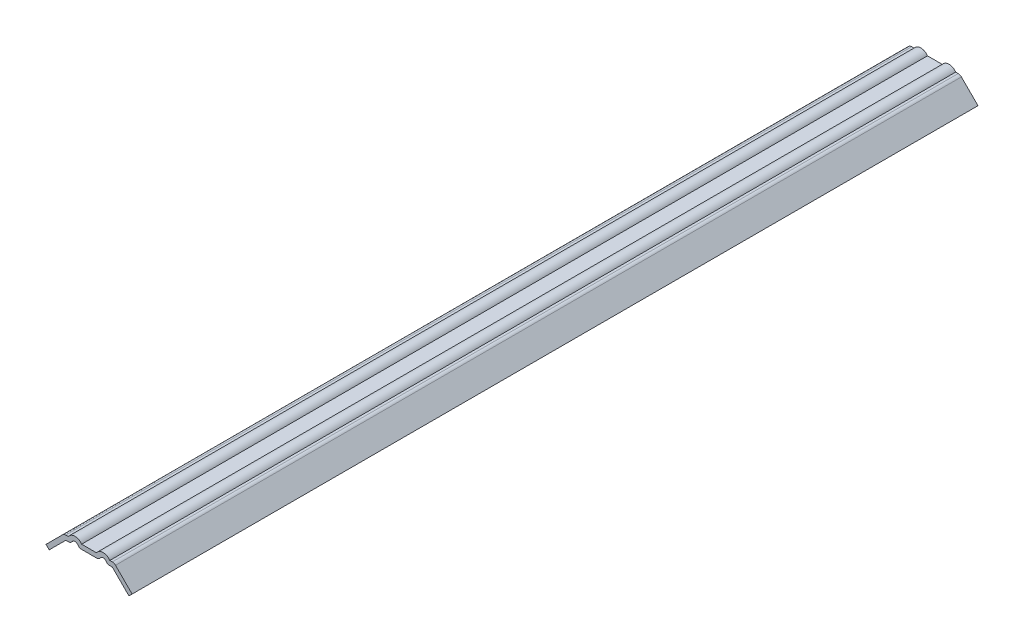
ISO-10303-21;
HEADER;
FILE_DESCRIPTION(('STEP AP214'),'2;1');
FILE_NAME('part.step','',(''),(''),'','','');
FILE_SCHEMA(('AUTOMOTIVE_DESIGN { 1 0 10303 214 1 1 1 1 }'));
ENDSEC;
DATA;
#1=APPLICATION_CONTEXT('core data for automotive mechanical design processes');
#2=APPLICATION_PROTOCOL_DEFINITION('international standard','automotive_design',2000,#1);
#3=PRODUCT_CONTEXT('',#1,'mechanical');
#4=PRODUCT('Part','Part','',(#3));
#5=PRODUCT_RELATED_PRODUCT_CATEGORY('part','',(#4));
#6=PRODUCT_DEFINITION_FORMATION('','',#4);
#7=PRODUCT_DEFINITION_CONTEXT('part definition',#1,'design');
#8=PRODUCT_DEFINITION('design','',#6,#7);
#9=PRODUCT_DEFINITION_SHAPE('','',#8);
#10=(LENGTH_UNIT() NAMED_UNIT(*) SI_UNIT(.MILLI.,.METRE.));
#11=(NAMED_UNIT(*) PLANE_ANGLE_UNIT() SI_UNIT($,.RADIAN.));
#12=(NAMED_UNIT(*) SI_UNIT($,.STERADIAN.) SOLID_ANGLE_UNIT());
#13=UNCERTAINTY_MEASURE_WITH_UNIT(LENGTH_MEASURE(1.E-05),#10,'distance_accuracy_value','');
#14=(GEOMETRIC_REPRESENTATION_CONTEXT(3) GLOBAL_UNCERTAINTY_ASSIGNED_CONTEXT((#13)) GLOBAL_UNIT_ASSIGNED_CONTEXT((#10,
#11,#12)) REPRESENTATION_CONTEXT('',''));
#15=CARTESIAN_POINT('',(0.,0.,0.));
#16=DIRECTION('',(0.,0.,1.));
#17=DIRECTION('',(1.,0.,0.));
#18=AXIS2_PLACEMENT_3D('',#15,#16,#17);
#19=CARTESIAN_POINT('',(-17.8707096809274,40.3213499836006,-571.5));
#20=DIRECTION('',(-0.707106781186544,0.707106781186551,0.));
#21=DIRECTION('',(-0.707106781186551,-0.707106781186544,0.));
#22=AXIS2_PLACEMENT_3D('',#19,#20,#21);
#23=PLANE('',#22);
#24=DIRECTION('',(-0.707106781186551,-0.707106781186544,0.));
#25=VECTOR('',#24,1.);
#26=CARTESIAN_POINT('',(-17.8707096809274,40.3213499836006,0.));
#27=LINE('',#26,#25);
#28=CARTESIAN_POINT('',(-17.8707096809274,40.3213499836006,0.));
#29=VERTEX_POINT('',#28);
#30=CARTESIAN_POINT('',(-29.0960298322639,29.0960298322642,0.));
#31=VERTEX_POINT('',#30);
#32=EDGE_CURVE('E250',#29,#31,#27,.T.);
#33=ORIENTED_EDGE('',*,*,#32,.F.);
#34=DIRECTION('',(0.,0.,1.));
#35=VECTOR('',#34,1.);
#36=CARTESIAN_POINT('',(-17.8707096809274,40.3213499836006,-571.5));
#37=LINE('',#36,#35);
#38=CARTESIAN_POINT('',(-17.8707096809274,40.3213499836006,-571.5));
#39=VERTEX_POINT('',#38);
#40=EDGE_CURVE('E11',#29,#39,#37,.F.);
#41=ORIENTED_EDGE('',*,*,#40,.T.);
#42=DIRECTION('',(-0.707106781186551,-0.707106781186544,0.));
#43=VECTOR('',#42,1.);
#44=CARTESIAN_POINT('',(-17.8707096809274,40.3213499836006,-571.5));
#45=LINE('',#44,#43);
#46=CARTESIAN_POINT('',(-29.0960298322639,29.0960298322642,-571.5));
#47=VERTEX_POINT('',#46);
#48=EDGE_CURVE('E251',#39,#47,#45,.T.);
#49=ORIENTED_EDGE('',*,*,#48,.T.);
#50=DIRECTION('',(0.,0.,1.));
#51=VECTOR('',#50,1.);
#52=CARTESIAN_POINT('',(-29.0960298322639,29.0960298322642,-571.5));
#53=LINE('',#52,#51);
#54=EDGE_CURVE('E273',#47,#31,#53,.T.);
#55=ORIENTED_EDGE('',*,*,#54,.T.);
#56=EDGE_LOOP('',(#33,#41,#49,#55));
#57=FACE_BOUND('',#56,.T.);
#58=ADVANCED_FACE('F37',(#57),#23,.T.);
#59=CARTESIAN_POINT('',(-11.90625,41.214088514544,-571.5));
#60=DIRECTION('',(0.,1.,0.));
#61=DIRECTION('',(-1.,0.,0.));
#62=AXIS2_PLACEMENT_3D('',#59,#60,#61);
#63=PLANE('',#62);
#64=DIRECTION('',(-1.,0.,0.));
#65=VECTOR('',#64,1.);
#66=CARTESIAN_POINT('',(-11.90625,41.214088514544,-571.5));
#67=LINE('',#66,#65);
#68=CARTESIAN_POINT('',(-14.017933514142,41.214088514544,-571.5));
#69=VERTEX_POINT('',#68);
#70=CARTESIAN_POINT('',(-15.7154482118708,41.214088514544,-571.5));
#71=VERTEX_POINT('',#70);
#72=EDGE_CURVE('E271',#69,#71,#67,.T.);
#73=ORIENTED_EDGE('',*,*,#72,.T.);
#74=DIRECTION('',(0.,0.,1.));
#75=VECTOR('',#74,1.);
#76=CARTESIAN_POINT('',(-15.7154482118708,41.214088514544,-571.5));
#77=LINE('',#76,#75);
#78=CARTESIAN_POINT('',(-15.7154482118708,41.214088514544,0.));
#79=VERTEX_POINT('',#78);
#80=EDGE_CURVE('E45',#71,#79,#77,.T.);
#81=ORIENTED_EDGE('',*,*,#80,.T.);
#82=DIRECTION('',(-1.,0.,0.));
#83=VECTOR('',#82,1.);
#84=CARTESIAN_POINT('',(-11.90625,41.214088514544,0.));
#85=LINE('',#84,#83);
#86=CARTESIAN_POINT('',(-14.017933514142,41.214088514544,0.));
#87=VERTEX_POINT('',#86);
#88=EDGE_CURVE('E254',#87,#79,#85,.T.);
#89=ORIENTED_EDGE('',*,*,#88,.F.);
#90=DIRECTION('',(0.,0.,1.));
#91=VECTOR('',#90,1.);
#92=CARTESIAN_POINT('',(-14.017933514142,41.214088514544,-571.5));
#93=LINE('',#92,#91);
#94=EDGE_CURVE('E296',#69,#87,#93,.T.);
#95=ORIENTED_EDGE('',*,*,#94,.F.);
#96=EDGE_LOOP('',(#73,#81,#89,#95));
#97=FACE_BOUND('',#96,.T.);
#98=ADVANCED_FACE('F331',(#97),#63,.T.);
#99=CARTESIAN_POINT('',(-9.525,38.166088514544,-571.5));
#100=DIRECTION('',(0.,0.,1.));
#101=DIRECTION('',(1.,0.,0.));
#102=AXIS2_PLACEMENT_3D('',#99,#100,#101);
#103=CYLINDRICAL_SURFACE('',#102,5.42925);
#104=CARTESIAN_POINT('',(-9.525,38.166088514544,0.));
#105=DIRECTION('',(0.,0.,1.));
#106=DIRECTION('',(1.,0.,0.));
#107=AXIS2_PLACEMENT_3D('',#104,#105,#106);
#108=CIRCLE('',#107,5.42925);
#109=CARTESIAN_POINT('',(-5.03206648585805,41.214088514544,0.));
#110=VERTEX_POINT('',#109);
#111=EDGE_CURVE('E291',#110,#87,#108,.T.);
#112=ORIENTED_EDGE('',*,*,#111,.F.);
#113=DIRECTION('',(0.,0.,1.));
#114=VECTOR('',#113,1.);
#115=CARTESIAN_POINT('',(-5.03206648585805,41.214088514544,-571.5));
#116=LINE('',#115,#114);
#117=CARTESIAN_POINT('',(-5.03206648585805,41.214088514544,-571.5));
#118=VERTEX_POINT('',#117);
#119=EDGE_CURVE('E299',#118,#110,#116,.T.);
#120=ORIENTED_EDGE('',*,*,#119,.F.);
#121=CARTESIAN_POINT('',(-9.525,38.166088514544,-571.5));
#122=DIRECTION('',(0.,0.,1.));
#123=DIRECTION('',(1.,0.,0.));
#124=AXIS2_PLACEMENT_3D('',#121,#122,#123);
#125=CIRCLE('',#124,5.42925);
#126=EDGE_CURVE('E268',#118,#69,#125,.T.);
#127=ORIENTED_EDGE('',*,*,#126,.T.);
#128=ORIENTED_EDGE('',*,*,#94,.T.);
#129=EDGE_LOOP('',(#112,#120,#127,#128));
#130=FACE_BOUND('',#129,.T.);
#131=ADVANCED_FACE('F340',(#130),#103,.T.);
#132=CARTESIAN_POINT('',(0.,41.214088514544,-571.5));
#133=DIRECTION('',(0.,1.,0.));
#134=DIRECTION('',(-1.,0.,0.));
#135=AXIS2_PLACEMENT_3D('',#132,#133,#134);
#136=PLANE('',#135);
#137=DIRECTION('',(-1.,0.,0.));
#138=VECTOR('',#137,1.);
#139=CARTESIAN_POINT('',(0.,41.214088514544,0.));
#140=LINE('',#139,#138);
#141=CARTESIAN_POINT('',(5.03206648585797,41.214088514544,0.));
#142=VERTEX_POINT('',#141);
#143=EDGE_CURVE('E288',#142,#110,#140,.T.);
#144=ORIENTED_EDGE('',*,*,#143,.F.);
#145=DIRECTION('',(0.,0.,1.));
#146=VECTOR('',#145,1.);
#147=CARTESIAN_POINT('',(5.03206648585797,41.214088514544,-571.5));
#148=LINE('',#147,#146);
#149=CARTESIAN_POINT('',(5.03206648585797,41.214088514544,-571.5));
#150=VERTEX_POINT('',#149);
#151=EDGE_CURVE('E346',#150,#142,#148,.T.);
#152=ORIENTED_EDGE('',*,*,#151,.F.);
#153=DIRECTION('',(-1.,0.,0.));
#154=VECTOR('',#153,1.);
#155=CARTESIAN_POINT('',(0.,41.214088514544,-571.5));
#156=LINE('',#155,#154);
#157=EDGE_CURVE('E265',#150,#118,#156,.T.);
#158=ORIENTED_EDGE('',*,*,#157,.T.);
#159=ORIENTED_EDGE('',*,*,#119,.T.);
#160=EDGE_LOOP('',(#144,#152,#158,#159));
#161=FACE_BOUND('',#160,.T.);
#162=ADVANCED_FACE('F344',(#161),#136,.T.);
#163=CARTESIAN_POINT('',(0.,38.166088514544,-571.5));
#164=DIRECTION('',(0.,1.,0.));
#165=DIRECTION('',(-1.,0.,0.));
#166=AXIS2_PLACEMENT_3D('',#163,#164,#165);
#167=PLANE('',#166);
#168=DIRECTION('',(-1.,0.,0.));
#169=VECTOR('',#168,1.);
#170=CARTESIAN_POINT('',(0.,38.166088514544,0.));
#171=LINE('',#170,#169);
#172=CARTESIAN_POINT('',(5.03206648585797,38.166088514544,0.));
#173=VERTEX_POINT('',#172);
#174=CARTESIAN_POINT('',(-5.03206648585804,38.166088514544,0.));
#175=VERTEX_POINT('',#174);
#176=EDGE_CURVE('E285',#173,#175,#171,.T.);
#177=ORIENTED_EDGE('',*,*,#176,.T.);
#178=DIRECTION('',(0.,0.,1.));
#179=VECTOR('',#178,1.);
#180=CARTESIAN_POINT('',(-5.03206648585804,38.166088514544,-571.5));
#181=LINE('',#180,#179);
#182=CARTESIAN_POINT('',(-5.03206648585804,38.166088514544,-571.5));
#183=VERTEX_POINT('',#182);
#184=EDGE_CURVE('E319',#175,#183,#181,.F.);
#185=ORIENTED_EDGE('',*,*,#184,.T.);
#186=DIRECTION('',(-1.,0.,0.));
#187=VECTOR('',#186,1.);
#188=CARTESIAN_POINT('',(0.,38.166088514544,-571.5));
#189=LINE('',#188,#187);
#190=CARTESIAN_POINT('',(5.03206648585797,38.166088514544,-571.5));
#191=VERTEX_POINT('',#190);
#192=EDGE_CURVE('E263',#191,#183,#189,.T.);
#193=ORIENTED_EDGE('',*,*,#192,.F.);
#194=DIRECTION('',(0.,0.,1.));
#195=VECTOR('',#194,1.);
#196=CARTESIAN_POINT('',(5.03206648585797,38.166088514544,-571.5));
#197=LINE('',#196,#195);
#198=EDGE_CURVE('E234',#173,#191,#197,.F.);
#199=ORIENTED_EDGE('',*,*,#198,.F.);
#200=EDGE_LOOP('',(#177,#185,#193,#199));
#201=FACE_BOUND('',#200,.T.);
#202=ADVANCED_FACE('F460',(#201),#167,.F.);
#203=CARTESIAN_POINT('',(-9.525,38.166088514544,-571.5));
#204=DIRECTION('',(0.,0.,1.));
#205=DIRECTION('',(1.,0.,0.));
#206=AXIS2_PLACEMENT_3D('',#203,#204,#205);
#207=CYLINDRICAL_SURFACE('',#206,2.38125);
#208=CARTESIAN_POINT('',(-9.525,38.166088514544,-571.5));
#209=DIRECTION('',(0.,0.,1.));
#210=DIRECTION('',(1.,0.,0.));
#211=AXIS2_PLACEMENT_3D('',#208,#209,#210);
#212=CIRCLE('',#211,2.38125);
#213=CARTESIAN_POINT('',(-7.55441512537634,39.5029306198071,-571.5));
#214=VERTEX_POINT('',#213);
#215=CARTESIAN_POINT('',(-11.4955848746237,39.5029306198071,-571.5));
#216=VERTEX_POINT('',#215);
#217=EDGE_CURVE('E261',#214,#216,#212,.T.);
#218=ORIENTED_EDGE('',*,*,#217,.F.);
#219=DIRECTION('',(0.,0.,1.));
#220=VECTOR('',#219,1.);
#221=CARTESIAN_POINT('',(-7.55441512537634,39.5029306198071,-571.5));
#222=LINE('',#221,#220);
#223=CARTESIAN_POINT('',(-7.55441512537634,39.5029306198071,0.));
#224=VERTEX_POINT('',#223);
#225=EDGE_CURVE('E310',#214,#224,#222,.T.);
#226=ORIENTED_EDGE('',*,*,#225,.T.);
#227=CARTESIAN_POINT('',(-9.525,38.166088514544,0.));
#228=DIRECTION('',(0.,0.,1.));
#229=DIRECTION('',(1.,0.,0.));
#230=AXIS2_PLACEMENT_3D('',#227,#228,#229);
#231=CIRCLE('',#230,2.38125);
#232=CARTESIAN_POINT('',(-11.4955848746237,39.5029306198071,0.));
#233=VERTEX_POINT('',#232);
#234=EDGE_CURVE('E282',#224,#233,#231,.T.);
#235=ORIENTED_EDGE('',*,*,#234,.T.);
#236=DIRECTION('',(0.,0.,1.));
#237=VECTOR('',#236,1.);
#238=CARTESIAN_POINT('',(-11.4955848746237,39.5029306198071,-571.5));
#239=LINE('',#238,#237);
#240=EDGE_CURVE('E298',#233,#216,#239,.F.);
#241=ORIENTED_EDGE('',*,*,#240,.T.);
#242=EDGE_LOOP('',(#218,#226,#235,#241));
#243=FACE_BOUND('',#242,.T.);
#244=ADVANCED_FACE('F408',(#243),#207,.F.);
#245=CARTESIAN_POINT('',(-11.90625,38.166088514544,-571.5));
#246=DIRECTION('',(0.,1.,0.));
#247=DIRECTION('',(-1.,0.,0.));
#248=AXIS2_PLACEMENT_3D('',#245,#246,#247);
#249=PLANE('',#248);
#250=DIRECTION('',(-1.,0.,0.));
#251=VECTOR('',#250,1.);
#252=CARTESIAN_POINT('',(-11.90625,38.166088514544,-571.5));
#253=LINE('',#252,#251);
#254=CARTESIAN_POINT('',(-14.017933514142,38.166088514544,-571.5));
#255=VERTEX_POINT('',#254);
#256=CARTESIAN_POINT('',(-15.7154482118708,38.166088514544,-571.5));
#257=VERTEX_POINT('',#256);
#258=EDGE_CURVE('E259',#255,#257,#253,.T.);
#259=ORIENTED_EDGE('',*,*,#258,.F.);
#260=DIRECTION('',(0.,0.,1.));
#261=VECTOR('',#260,1.);
#262=CARTESIAN_POINT('',(-14.017933514142,38.166088514544,-571.5));
#263=LINE('',#262,#261);
#264=CARTESIAN_POINT('',(-14.017933514142,38.166088514544,0.));
#265=VERTEX_POINT('',#264);
#266=EDGE_CURVE('E325',#255,#265,#263,.T.);
#267=ORIENTED_EDGE('',*,*,#266,.T.);
#268=DIRECTION('',(-1.,0.,0.));
#269=VECTOR('',#268,1.);
#270=CARTESIAN_POINT('',(-11.90625,38.166088514544,0.));
#271=LINE('',#270,#269);
#272=CARTESIAN_POINT('',(-15.7154482118708,38.166088514544,0.));
#273=VERTEX_POINT('',#272);
#274=EDGE_CURVE('E280',#265,#273,#271,.T.);
#275=ORIENTED_EDGE('',*,*,#274,.T.);
#276=DIRECTION('',(0.,0.,1.));
#277=VECTOR('',#276,1.);
#278=CARTESIAN_POINT('',(-15.7154482118708,38.166088514544,-571.5));
#279=LINE('',#278,#277);
#280=EDGE_CURVE('E301',#257,#273,#279,.T.);
#281=ORIENTED_EDGE('',*,*,#280,.F.);
#282=EDGE_LOOP('',(#259,#267,#275,#281));
#283=FACE_BOUND('',#282,.T.);
#284=ADVANCED_FACE('F416',(#283),#249,.F.);
#285=CARTESIAN_POINT('',(-15.7154482118708,38.166088514544,-571.5));
#286=DIRECTION('',(-0.707106781186544,0.707106781186551,0.));
#287=DIRECTION('',(-0.707106781186551,-0.707106781186544,0.));
#288=AXIS2_PLACEMENT_3D('',#285,#286,#287);
#289=PLANE('',#288);
#290=DIRECTION('',(-0.707106781186551,-0.707106781186544,0.));
#291=VECTOR('',#290,1.);
#292=CARTESIAN_POINT('',(-15.7154482118708,38.166088514544,0.));
#293=LINE('',#292,#291);
#294=CARTESIAN_POINT('',(-26.9407683632073,26.9407683632076,0.));
#295=VERTEX_POINT('',#294);
#296=EDGE_CURVE('E278',#273,#295,#293,.T.);
#297=ORIENTED_EDGE('',*,*,#296,.T.);
#298=DIRECTION('',(0.,0.,1.));
#299=VECTOR('',#298,1.);
#300=CARTESIAN_POINT('',(-26.9407683632073,26.9407683632076,-571.5));
#301=LINE('',#300,#299);
#302=CARTESIAN_POINT('',(-26.9407683632073,26.9407683632076,-571.5));
#303=VERTEX_POINT('',#302);
#304=EDGE_CURVE('E304',#303,#295,#301,.T.);
#305=ORIENTED_EDGE('',*,*,#304,.F.);
#306=DIRECTION('',(-0.707106781186551,-0.707106781186544,0.));
#307=VECTOR('',#306,1.);
#308=CARTESIAN_POINT('',(-15.7154482118708,38.166088514544,-571.5));
#309=LINE('',#308,#307);
#310=EDGE_CURVE('E257',#257,#303,#309,.T.);
#311=ORIENTED_EDGE('',*,*,#310,.F.);
#312=ORIENTED_EDGE('',*,*,#280,.T.);
#313=EDGE_LOOP('',(#297,#305,#311,#312));
#314=FACE_BOUND('',#313,.T.);
#315=ADVANCED_FACE('F423',(#314),#289,.F.);
#316=CARTESIAN_POINT('',(-26.9407683632073,26.9407683632076,-571.5));
#317=DIRECTION('',(0.70710678118655,0.707106781186545,0.));
#318=DIRECTION('',(-0.707106781186545,0.70710678118655,0.));
#319=AXIS2_PLACEMENT_3D('',#316,#317,#318);
#320=PLANE('',#319);
#321=DIRECTION('',(-0.707106781186545,0.70710678118655,0.));
#322=VECTOR('',#321,1.);
#323=CARTESIAN_POINT('',(-26.9407683632073,26.9407683632076,0.));
#324=LINE('',#323,#322);
#325=EDGE_CURVE('E275',#295,#31,#324,.T.);
#326=ORIENTED_EDGE('',*,*,#325,.T.);
#327=ORIENTED_EDGE('',*,*,#54,.F.);
#328=DIRECTION('',(-0.707106781186545,0.70710678118655,0.));
#329=VECTOR('',#328,1.);
#330=CARTESIAN_POINT('',(-26.9407683632073,26.9407683632076,-571.5));
#331=LINE('',#330,#329);
#332=EDGE_CURVE('E253',#303,#47,#331,.T.);
#333=ORIENTED_EDGE('',*,*,#332,.F.);
#334=ORIENTED_EDGE('',*,*,#304,.T.);
#335=EDGE_LOOP('',(#326,#327,#333,#334));
#336=FACE_BOUND('',#335,.T.);
#337=ADVANCED_FACE('F426',(#336),#320,.F.);
#338=CARTESIAN_POINT('',(-9.525,38.166088514544,-571.5));
#339=DIRECTION('',(0.,0.,1.));
#340=DIRECTION('',(1.,0.,0.));
#341=AXIS2_PLACEMENT_3D('',#338,#339,#340);
#342=PLANE('',#341);
#343=ORIENTED_EDGE('',*,*,#192,.T.);
#344=CARTESIAN_POINT('',(-5.03206648585804,41.214088514544,-571.5));
#345=DIRECTION('',(0.,0.,1.));
#346=DIRECTION('',(1.,0.,0.));
#347=AXIS2_PLACEMENT_3D('',#344,#345,#346);
#348=CIRCLE('',#347,3.048);
#349=EDGE_CURVE('E323',#183,#214,#348,.F.);
#350=ORIENTED_EDGE('',*,*,#349,.T.);
#351=ORIENTED_EDGE('',*,*,#217,.T.);
#352=CARTESIAN_POINT('',(-14.017933514142,41.214088514544,-571.5));
#353=DIRECTION('',(0.,0.,1.));
#354=DIRECTION('',(1.,0.,0.));
#355=AXIS2_PLACEMENT_3D('',#352,#353,#354);
#356=CIRCLE('',#355,3.048);
#357=EDGE_CURVE('E52',#216,#255,#356,.F.);
#358=ORIENTED_EDGE('',*,*,#357,.T.);
#359=ORIENTED_EDGE('',*,*,#258,.T.);
#360=ORIENTED_EDGE('',*,*,#310,.T.);
#361=ORIENTED_EDGE('',*,*,#332,.T.);
#362=ORIENTED_EDGE('',*,*,#48,.F.);
#363=CARTESIAN_POINT('',(-15.7154482118708,38.166088514544,-571.5));
#364=DIRECTION('',(0.,0.,1.));
#365=DIRECTION('',(1.,0.,0.));
#366=AXIS2_PLACEMENT_3D('',#363,#364,#365);
#367=CIRCLE('',#366,3.048);
#368=EDGE_CURVE('E59',#39,#71,#367,.F.);
#369=ORIENTED_EDGE('',*,*,#368,.T.);
#370=ORIENTED_EDGE('',*,*,#72,.F.);
#371=ORIENTED_EDGE('',*,*,#126,.F.);
#372=ORIENTED_EDGE('',*,*,#157,.F.);
#373=CARTESIAN_POINT('',(9.52499999999993,38.166088514544,-571.5));
#374=DIRECTION('',(0.,0.,-1.));
#375=DIRECTION('',(-1.,0.,0.));
#376=AXIS2_PLACEMENT_3D('',#373,#374,#375);
#377=CIRCLE('',#376,5.42925);
#378=CARTESIAN_POINT('',(14.0179335141419,41.214088514544,-571.5));
#379=VERTEX_POINT('',#378);
#380=EDGE_CURVE('E216',#150,#379,#377,.T.);
#381=ORIENTED_EDGE('',*,*,#380,.T.);
#382=DIRECTION('',(1.,0.,0.));
#383=VECTOR('',#382,1.);
#384=CARTESIAN_POINT('',(11.9062499999999,41.214088514544,-571.5));
#385=LINE('',#384,#383);
#386=CARTESIAN_POINT('',(15.7154482118707,41.214088514544,-571.5));
#387=VERTEX_POINT('',#386);
#388=EDGE_CURVE('E212',#379,#387,#385,.T.);
#389=ORIENTED_EDGE('',*,*,#388,.T.);
#390=CARTESIAN_POINT('',(15.7154482118707,38.166088514544,-571.5));
#391=DIRECTION('',(0.,0.,-1.));
#392=DIRECTION('',(-1.,0.,0.));
#393=AXIS2_PLACEMENT_3D('',#390,#391,#392);
#394=CIRCLE('',#393,3.048);
#395=CARTESIAN_POINT('',(17.8707096809273,40.3213499836006,-571.5));
#396=VERTEX_POINT('',#395);
#397=EDGE_CURVE('E203',#396,#387,#394,.F.);
#398=ORIENTED_EDGE('',*,*,#397,.F.);
#399=DIRECTION('',(0.707106781186552,-0.707106781186543,0.));
#400=VECTOR('',#399,1.);
#401=CARTESIAN_POINT('',(17.8707096809273,40.3213499836006,-571.5));
#402=LINE('',#401,#400);
#403=CARTESIAN_POINT('',(29.0960298322639,29.0960298322643,-571.5));
#404=VERTEX_POINT('',#403);
#405=EDGE_CURVE('E197',#396,#404,#402,.T.);
#406=ORIENTED_EDGE('',*,*,#405,.T.);
#407=DIRECTION('',(0.707106781186544,0.707106781186551,0.));
#408=VECTOR('',#407,1.);
#409=CARTESIAN_POINT('',(26.9407683632073,26.9407683632077,-571.5));
#410=LINE('',#409,#408);
#411=CARTESIAN_POINT('',(26.9407683632073,26.9407683632077,-571.5));
#412=VERTEX_POINT('',#411);
#413=EDGE_CURVE('E187',#412,#404,#410,.T.);
#414=ORIENTED_EDGE('',*,*,#413,.F.);
#415=DIRECTION('',(0.707106781186552,-0.707106781186543,0.));
#416=VECTOR('',#415,1.);
#417=CARTESIAN_POINT('',(15.7154482118707,38.166088514544,-571.5));
#418=LINE('',#417,#416);
#419=CARTESIAN_POINT('',(15.7154482118707,38.166088514544,-571.5));
#420=VERTEX_POINT('',#419);
#421=EDGE_CURVE('E196',#420,#412,#418,.T.);
#422=ORIENTED_EDGE('',*,*,#421,.F.);
#423=DIRECTION('',(1.,0.,0.));
#424=VECTOR('',#423,1.);
#425=CARTESIAN_POINT('',(11.9062499999999,38.166088514544,-571.5));
#426=LINE('',#425,#424);
#427=CARTESIAN_POINT('',(14.0179335141419,38.166088514544,-571.5));
#428=VERTEX_POINT('',#427);
#429=EDGE_CURVE('E357',#428,#420,#426,.T.);
#430=ORIENTED_EDGE('',*,*,#429,.F.);
#431=CARTESIAN_POINT('',(14.0179335141419,41.214088514544,-571.5));
#432=DIRECTION('',(0.,0.,-1.));
#433=DIRECTION('',(-1.,0.,0.));
#434=AXIS2_PLACEMENT_3D('',#431,#432,#433);
#435=CIRCLE('',#434,3.048);
#436=CARTESIAN_POINT('',(11.4955848746236,39.5029306198072,-571.5));
#437=VERTEX_POINT('',#436);
#438=EDGE_CURVE('E238',#437,#428,#435,.F.);
#439=ORIENTED_EDGE('',*,*,#438,.F.);
#440=CARTESIAN_POINT('',(9.52499999999993,38.166088514544,-571.5));
#441=DIRECTION('',(0.,0.,-1.));
#442=DIRECTION('',(-1.,0.,0.));
#443=AXIS2_PLACEMENT_3D('',#440,#441,#442);
#444=CIRCLE('',#443,2.38125);
#445=CARTESIAN_POINT('',(7.55441512537626,39.5029306198072,-571.5));
#446=VERTEX_POINT('',#445);
#447=EDGE_CURVE('E354',#446,#437,#444,.T.);
#448=ORIENTED_EDGE('',*,*,#447,.F.);
#449=CARTESIAN_POINT('',(5.03206648585796,41.214088514544,-571.5));
#450=DIRECTION('',(0.,0.,-1.));
#451=DIRECTION('',(-1.,0.,0.));
#452=AXIS2_PLACEMENT_3D('',#449,#450,#451);
#453=CIRCLE('',#452,3.048);
#454=EDGE_CURVE('E240',#191,#446,#453,.F.);
#455=ORIENTED_EDGE('',*,*,#454,.F.);
#456=EDGE_LOOP('',(#343,#350,#351,#358,#359,#360,#361,#362,#369,#370,#371,#372,#381,#389,#398,
#406,#414,#422,#430,#439,#448,#455));
#457=FACE_BOUND('',#456,.T.);
#458=ADVANCED_FACE('F201',(#457),#342,.F.);
#459=CARTESIAN_POINT('',(-9.525,38.166088514544,0.));
#460=DIRECTION('',(0.,0.,1.));
#461=DIRECTION('',(1.,0.,0.));
#462=AXIS2_PLACEMENT_3D('',#459,#460,#461);
#463=PLANE('',#462);
#464=ORIENTED_EDGE('',*,*,#234,.F.);
#465=CARTESIAN_POINT('',(-5.03206648585804,41.214088514544,0.));
#466=DIRECTION('',(0.,0.,1.));
#467=DIRECTION('',(1.,0.,0.));
#468=AXIS2_PLACEMENT_3D('',#465,#466,#467);
#469=CIRCLE('',#468,3.048);
#470=EDGE_CURVE('E317',#224,#175,#469,.T.);
#471=ORIENTED_EDGE('',*,*,#470,.T.);
#472=ORIENTED_EDGE('',*,*,#176,.F.);
#473=CARTESIAN_POINT('',(5.03206648585796,41.214088514544,0.));
#474=DIRECTION('',(0.,0.,-1.));
#475=DIRECTION('',(-1.,0.,0.));
#476=AXIS2_PLACEMENT_3D('',#473,#474,#475);
#477=CIRCLE('',#476,3.048);
#478=CARTESIAN_POINT('',(7.55441512537626,39.5029306198072,0.));
#479=VERTEX_POINT('',#478);
#480=EDGE_CURVE('E231',#479,#173,#477,.T.);
#481=ORIENTED_EDGE('',*,*,#480,.F.);
#482=CARTESIAN_POINT('',(9.52499999999993,38.166088514544,0.));
#483=DIRECTION('',(0.,0.,-1.));
#484=DIRECTION('',(-1.,0.,0.));
#485=AXIS2_PLACEMENT_3D('',#482,#483,#484);
#486=CIRCLE('',#485,2.38125);
#487=CARTESIAN_POINT('',(11.4955848746236,39.5029306198072,0.));
#488=VERTEX_POINT('',#487);
#489=EDGE_CURVE('E370',#479,#488,#486,.T.);
#490=ORIENTED_EDGE('',*,*,#489,.T.);
#491=CARTESIAN_POINT('',(14.0179335141419,41.214088514544,0.));
#492=DIRECTION('',(0.,0.,-1.));
#493=DIRECTION('',(-1.,0.,0.));
#494=AXIS2_PLACEMENT_3D('',#491,#492,#493);
#495=CIRCLE('',#494,3.048);
#496=CARTESIAN_POINT('',(14.0179335141419,38.166088514544,0.));
#497=VERTEX_POINT('',#496);
#498=EDGE_CURVE('E229',#497,#488,#495,.T.);
#499=ORIENTED_EDGE('',*,*,#498,.F.);
#500=DIRECTION('',(1.,0.,0.));
#501=VECTOR('',#500,1.);
#502=CARTESIAN_POINT('',(11.9062499999999,38.166088514544,0.));
#503=LINE('',#502,#501);
#504=CARTESIAN_POINT('',(15.7154482118707,38.166088514544,0.));
#505=VERTEX_POINT('',#504);
#506=EDGE_CURVE('E367',#497,#505,#503,.T.);
#507=ORIENTED_EDGE('',*,*,#506,.T.);
#508=DIRECTION('',(0.707106781186552,-0.707106781186543,0.));
#509=VECTOR('',#508,1.);
#510=CARTESIAN_POINT('',(15.7154482118707,38.166088514544,0.));
#511=LINE('',#510,#509);
#512=CARTESIAN_POINT('',(26.9407683632073,26.9407683632077,0.));
#513=VERTEX_POINT('',#512);
#514=EDGE_CURVE('E364',#505,#513,#511,.T.);
#515=ORIENTED_EDGE('',*,*,#514,.T.);
#516=DIRECTION('',(0.707106781186544,0.707106781186551,0.));
#517=VECTOR('',#516,1.);
#518=CARTESIAN_POINT('',(26.9407683632073,26.9407683632077,0.));
#519=LINE('',#518,#517);
#520=CARTESIAN_POINT('',(29.0960298322639,29.0960298322643,0.));
#521=VERTEX_POINT('',#520);
#522=EDGE_CURVE('E362',#513,#521,#519,.T.);
#523=ORIENTED_EDGE('',*,*,#522,.T.);
#524=DIRECTION('',(0.707106781186552,-0.707106781186543,0.));
#525=VECTOR('',#524,1.);
#526=CARTESIAN_POINT('',(17.8707096809273,40.3213499836006,0.));
#527=LINE('',#526,#525);
#528=CARTESIAN_POINT('',(17.8707096809273,40.3213499836006,0.));
#529=VERTEX_POINT('',#528);
#530=EDGE_CURVE('E211',#529,#521,#527,.T.);
#531=ORIENTED_EDGE('',*,*,#530,.F.);
#532=CARTESIAN_POINT('',(15.7154482118707,38.166088514544,0.));
#533=DIRECTION('',(0.,0.,-1.));
#534=DIRECTION('',(-1.,0.,0.));
#535=AXIS2_PLACEMENT_3D('',#532,#533,#534);
#536=CIRCLE('',#535,3.048);
#537=CARTESIAN_POINT('',(15.7154482118707,41.214088514544,0.));
#538=VERTEX_POINT('',#537);
#539=EDGE_CURVE('E227',#538,#529,#536,.T.);
#540=ORIENTED_EDGE('',*,*,#539,.F.);
#541=DIRECTION('',(1.,0.,0.));
#542=VECTOR('',#541,1.);
#543=CARTESIAN_POINT('',(11.9062499999999,41.214088514544,0.));
#544=LINE('',#543,#542);
#545=CARTESIAN_POINT('',(14.0179335141419,41.214088514544,0.));
#546=VERTEX_POINT('',#545);
#547=EDGE_CURVE('E207',#546,#538,#544,.T.);
#548=ORIENTED_EDGE('',*,*,#547,.F.);
#549=CARTESIAN_POINT('',(9.52499999999993,38.166088514544,0.));
#550=DIRECTION('',(0.,0.,-1.));
#551=DIRECTION('',(-1.,0.,0.));
#552=AXIS2_PLACEMENT_3D('',#549,#550,#551);
#553=CIRCLE('',#552,5.42925);
#554=EDGE_CURVE('E373',#142,#546,#553,.T.);
#555=ORIENTED_EDGE('',*,*,#554,.F.);
#556=ORIENTED_EDGE('',*,*,#143,.T.);
#557=ORIENTED_EDGE('',*,*,#111,.T.);
#558=ORIENTED_EDGE('',*,*,#88,.T.);
#559=CARTESIAN_POINT('',(-15.7154482118708,38.166088514544,0.));
#560=DIRECTION('',(0.,0.,1.));
#561=DIRECTION('',(1.,0.,0.));
#562=AXIS2_PLACEMENT_3D('',#559,#560,#561);
#563=CIRCLE('',#562,3.048);
#564=EDGE_CURVE('E313',#79,#29,#563,.T.);
#565=ORIENTED_EDGE('',*,*,#564,.T.);
#566=ORIENTED_EDGE('',*,*,#32,.T.);
#567=ORIENTED_EDGE('',*,*,#325,.F.);
#568=ORIENTED_EDGE('',*,*,#296,.F.);
#569=ORIENTED_EDGE('',*,*,#274,.F.);
#570=CARTESIAN_POINT('',(-14.017933514142,41.214088514544,0.));
#571=DIRECTION('',(0.,0.,1.));
#572=DIRECTION('',(1.,0.,0.));
#573=AXIS2_PLACEMENT_3D('',#570,#571,#572);
#574=CIRCLE('',#573,3.048);
#575=EDGE_CURVE('E315',#265,#233,#574,.T.);
#576=ORIENTED_EDGE('',*,*,#575,.T.);
#577=EDGE_LOOP('',(#464,#471,#472,#481,#490,#499,#507,#515,#523,#531,#540,#548,#555,#556,#557,
#558,#565,#566,#567,#568,#569,#576));
#578=FACE_BOUND('',#577,.T.);
#579=ADVANCED_FACE('F335',(#578),#463,.T.);
#580=CARTESIAN_POINT('',(-5.03206648585804,41.214088514544,-571.5));
#581=DIRECTION('',(0.,0.,1.));
#582=DIRECTION('',(1.,0.,0.));
#583=AXIS2_PLACEMENT_3D('',#580,#581,#582);
#584=CYLINDRICAL_SURFACE('',#583,3.048);
#585=ORIENTED_EDGE('',*,*,#349,.F.);
#586=ORIENTED_EDGE('',*,*,#184,.F.);
#587=ORIENTED_EDGE('',*,*,#470,.F.);
#588=ORIENTED_EDGE('',*,*,#225,.F.);
#589=EDGE_LOOP('',(#585,#586,#587,#588));
#590=FACE_BOUND('',#589,.T.);
#591=ADVANCED_FACE('F406',(#590),#584,.T.);
#592=CARTESIAN_POINT('',(-14.017933514142,41.214088514544,-571.5));
#593=DIRECTION('',(0.,0.,1.));
#594=DIRECTION('',(1.,0.,0.));
#595=AXIS2_PLACEMENT_3D('',#592,#593,#594);
#596=CYLINDRICAL_SURFACE('',#595,3.048);
#597=ORIENTED_EDGE('',*,*,#357,.F.);
#598=ORIENTED_EDGE('',*,*,#240,.F.);
#599=ORIENTED_EDGE('',*,*,#575,.F.);
#600=ORIENTED_EDGE('',*,*,#266,.F.);
#601=EDGE_LOOP('',(#597,#598,#599,#600));
#602=FACE_BOUND('',#601,.T.);
#603=ADVANCED_FACE('F414',(#602),#596,.T.);
#604=CARTESIAN_POINT('',(-15.7154482118708,38.166088514544,-571.5));
#605=DIRECTION('',(0.,0.,1.));
#606=DIRECTION('',(1.,0.,0.));
#607=AXIS2_PLACEMENT_3D('',#604,#605,#606);
#608=CYLINDRICAL_SURFACE('',#607,3.048);
#609=ORIENTED_EDGE('',*,*,#368,.F.);
#610=ORIENTED_EDGE('',*,*,#40,.F.);
#611=ORIENTED_EDGE('',*,*,#564,.F.);
#612=ORIENTED_EDGE('',*,*,#80,.F.);
#613=EDGE_LOOP('',(#609,#610,#611,#612));
#614=FACE_BOUND('',#613,.T.);
#615=ADVANCED_FACE('F39',(#614),#608,.T.);
#616=CARTESIAN_POINT('',(17.8707096809273,40.3213499836006,-571.5));
#617=DIRECTION('',(0.707106781186543,0.707106781186552,0.));
#618=DIRECTION('',(0.707106781186552,-0.707106781186543,0.));
#619=AXIS2_PLACEMENT_3D('',#616,#617,#618);
#620=PLANE('',#619);
#621=ORIENTED_EDGE('',*,*,#530,.T.);
#622=DIRECTION('',(0.,0.,1.));
#623=VECTOR('',#622,1.);
#624=CARTESIAN_POINT('',(29.0960298322639,29.0960298322643,-571.5));
#625=LINE('',#624,#623);
#626=EDGE_CURVE('E191',#404,#521,#625,.T.);
#627=ORIENTED_EDGE('',*,*,#626,.F.);
#628=ORIENTED_EDGE('',*,*,#405,.F.);
#629=DIRECTION('',(0.,0.,1.));
#630=VECTOR('',#629,1.);
#631=CARTESIAN_POINT('',(17.8707096809273,40.3213499836006,-571.5));
#632=LINE('',#631,#630);
#633=EDGE_CURVE('E248',#529,#396,#632,.F.);
#634=ORIENTED_EDGE('',*,*,#633,.F.);
#635=EDGE_LOOP('',(#621,#627,#628,#634));
#636=FACE_BOUND('',#635,.T.);
#637=ADVANCED_FACE('F209',(#636),#620,.T.);
#638=CARTESIAN_POINT('',(11.9062499999999,41.214088514544,-571.5));
#639=DIRECTION('',(0.,1.,0.));
#640=DIRECTION('',(1.,0.,0.));
#641=AXIS2_PLACEMENT_3D('',#638,#639,#640);
#642=PLANE('',#641);
#643=ORIENTED_EDGE('',*,*,#388,.F.);
#644=DIRECTION('',(0.,0.,1.));
#645=VECTOR('',#644,1.);
#646=CARTESIAN_POINT('',(14.0179335141419,41.214088514544,-571.5));
#647=LINE('',#646,#645);
#648=EDGE_CURVE('E224',#379,#546,#647,.T.);
#649=ORIENTED_EDGE('',*,*,#648,.T.);
#650=ORIENTED_EDGE('',*,*,#547,.T.);
#651=DIRECTION('',(0.,0.,1.));
#652=VECTOR('',#651,1.);
#653=CARTESIAN_POINT('',(15.7154482118707,41.214088514544,-571.5));
#654=LINE('',#653,#652);
#655=EDGE_CURVE('E245',#387,#538,#654,.T.);
#656=ORIENTED_EDGE('',*,*,#655,.F.);
#657=EDGE_LOOP('',(#643,#649,#650,#656));
#658=FACE_BOUND('',#657,.T.);
#659=ADVANCED_FACE('F434',(#658),#642,.T.);
#660=CARTESIAN_POINT('',(9.52499999999993,38.166088514544,-571.5));
#661=DIRECTION('',(0.,0.,1.));
#662=DIRECTION('',(-1.,0.,0.));
#663=AXIS2_PLACEMENT_3D('',#660,#661,#662);
#664=CYLINDRICAL_SURFACE('',#663,5.42925);
#665=ORIENTED_EDGE('',*,*,#554,.T.);
#666=ORIENTED_EDGE('',*,*,#648,.F.);
#667=ORIENTED_EDGE('',*,*,#380,.F.);
#668=ORIENTED_EDGE('',*,*,#151,.T.);
#669=EDGE_LOOP('',(#665,#666,#667,#668));
#670=FACE_BOUND('',#669,.T.);
#671=ADVANCED_FACE('F351',(#670),#664,.T.);
#672=CARTESIAN_POINT('',(9.52499999999993,38.166088514544,-571.5));
#673=DIRECTION('',(0.,0.,1.));
#674=DIRECTION('',(-1.,0.,0.));
#675=AXIS2_PLACEMENT_3D('',#672,#673,#674);
#676=CYLINDRICAL_SURFACE('',#675,2.38125);
#677=ORIENTED_EDGE('',*,*,#447,.T.);
#678=DIRECTION('',(0.,0.,1.));
#679=VECTOR('',#678,1.);
#680=CARTESIAN_POINT('',(11.4955848746236,39.5029306198072,-571.5));
#681=LINE('',#680,#679);
#682=EDGE_CURVE('E220',#488,#437,#681,.F.);
#683=ORIENTED_EDGE('',*,*,#682,.F.);
#684=ORIENTED_EDGE('',*,*,#489,.F.);
#685=DIRECTION('',(0.,0.,1.));
#686=VECTOR('',#685,1.);
#687=CARTESIAN_POINT('',(7.55441512537626,39.5029306198072,-571.5));
#688=LINE('',#687,#686);
#689=EDGE_CURVE('E223',#446,#479,#688,.T.);
#690=ORIENTED_EDGE('',*,*,#689,.F.);
#691=EDGE_LOOP('',(#677,#683,#684,#690));
#692=FACE_BOUND('',#691,.T.);
#693=ADVANCED_FACE('F396',(#692),#676,.F.);
#694=CARTESIAN_POINT('',(11.9062499999999,38.166088514544,-571.5));
#695=DIRECTION('',(0.,1.,0.));
#696=DIRECTION('',(1.,0.,0.));
#697=AXIS2_PLACEMENT_3D('',#694,#695,#696);
#698=PLANE('',#697);
#699=ORIENTED_EDGE('',*,*,#429,.T.);
#700=DIRECTION('',(0.,0.,1.));
#701=VECTOR('',#700,1.);
#702=CARTESIAN_POINT('',(15.7154482118707,38.166088514544,-571.5));
#703=LINE('',#702,#701);
#704=EDGE_CURVE('E214',#420,#505,#703,.T.);
#705=ORIENTED_EDGE('',*,*,#704,.T.);
#706=ORIENTED_EDGE('',*,*,#506,.F.);
#707=DIRECTION('',(0.,0.,1.));
#708=VECTOR('',#707,1.);
#709=CARTESIAN_POINT('',(14.0179335141419,38.166088514544,-571.5));
#710=LINE('',#709,#708);
#711=EDGE_CURVE('E242',#428,#497,#710,.T.);
#712=ORIENTED_EDGE('',*,*,#711,.F.);
#713=EDGE_LOOP('',(#699,#705,#706,#712));
#714=FACE_BOUND('',#713,.T.);
#715=ADVANCED_FACE('F382',(#714),#698,.F.);
#716=CARTESIAN_POINT('',(15.7154482118707,38.166088514544,-571.5));
#717=DIRECTION('',(0.707106781186543,0.707106781186552,0.));
#718=DIRECTION('',(0.707106781186552,-0.707106781186543,0.));
#719=AXIS2_PLACEMENT_3D('',#716,#717,#718);
#720=PLANE('',#719);
#721=ORIENTED_EDGE('',*,*,#514,.F.);
#722=ORIENTED_EDGE('',*,*,#704,.F.);
#723=ORIENTED_EDGE('',*,*,#421,.T.);
#724=DIRECTION('',(0.,0.,1.));
#725=VECTOR('',#724,1.);
#726=CARTESIAN_POINT('',(26.9407683632073,26.9407683632077,-571.5));
#727=LINE('',#726,#725);
#728=EDGE_CURVE('E194',#412,#513,#727,.T.);
#729=ORIENTED_EDGE('',*,*,#728,.T.);
#730=EDGE_LOOP('',(#721,#722,#723,#729));
#731=FACE_BOUND('',#730,.T.);
#732=ADVANCED_FACE('F386',(#731),#720,.F.);
#733=CARTESIAN_POINT('',(26.9407683632073,26.9407683632077,-571.5));
#734=DIRECTION('',(-0.707106781186551,0.707106781186544,0.));
#735=DIRECTION('',(0.707106781186544,0.707106781186551,0.));
#736=AXIS2_PLACEMENT_3D('',#733,#734,#735);
#737=PLANE('',#736);
#738=ORIENTED_EDGE('',*,*,#522,.F.);
#739=ORIENTED_EDGE('',*,*,#728,.F.);
#740=ORIENTED_EDGE('',*,*,#413,.T.);
#741=ORIENTED_EDGE('',*,*,#626,.T.);
#742=EDGE_LOOP('',(#738,#739,#740,#741));
#743=FACE_BOUND('',#742,.T.);
#744=ADVANCED_FACE('F189',(#743),#737,.F.);
#745=CARTESIAN_POINT('',(5.03206648585796,41.214088514544,-571.5));
#746=DIRECTION('',(0.,0.,1.));
#747=DIRECTION('',(-1.,0.,0.));
#748=AXIS2_PLACEMENT_3D('',#745,#746,#747);
#749=CYLINDRICAL_SURFACE('',#748,3.048);
#750=ORIENTED_EDGE('',*,*,#454,.T.);
#751=ORIENTED_EDGE('',*,*,#689,.T.);
#752=ORIENTED_EDGE('',*,*,#480,.T.);
#753=ORIENTED_EDGE('',*,*,#198,.T.);
#754=EDGE_LOOP('',(#750,#751,#752,#753));
#755=FACE_BOUND('',#754,.T.);
#756=ADVANCED_FACE('F398',(#755),#749,.T.);
#757=CARTESIAN_POINT('',(14.0179335141419,41.214088514544,-571.5));
#758=DIRECTION('',(0.,0.,1.));
#759=DIRECTION('',(-1.,0.,0.));
#760=AXIS2_PLACEMENT_3D('',#757,#758,#759);
#761=CYLINDRICAL_SURFACE('',#760,3.048);
#762=ORIENTED_EDGE('',*,*,#438,.T.);
#763=ORIENTED_EDGE('',*,*,#711,.T.);
#764=ORIENTED_EDGE('',*,*,#498,.T.);
#765=ORIENTED_EDGE('',*,*,#682,.T.);
#766=EDGE_LOOP('',(#762,#763,#764,#765));
#767=FACE_BOUND('',#766,.T.);
#768=ADVANCED_FACE('F390',(#767),#761,.T.);
#769=CARTESIAN_POINT('',(15.7154482118707,38.166088514544,-571.5));
#770=DIRECTION('',(0.,0.,1.));
#771=DIRECTION('',(-1.,0.,0.));
#772=AXIS2_PLACEMENT_3D('',#769,#770,#771);
#773=CYLINDRICAL_SURFACE('',#772,3.048);
#774=ORIENTED_EDGE('',*,*,#397,.T.);
#775=ORIENTED_EDGE('',*,*,#655,.T.);
#776=ORIENTED_EDGE('',*,*,#539,.T.);
#777=ORIENTED_EDGE('',*,*,#633,.T.);
#778=EDGE_LOOP('',(#774,#775,#776,#777));
#779=FACE_BOUND('',#778,.T.);
#780=ADVANCED_FACE('F562',(#779),#773,.T.);
#781=CLOSED_SHELL('',(#58,#98,#131,#162,#202,#244,#284,#315,#337,#458,#579,#591,#603,#615,#637,
#659,#671,#693,#715,#732,#744,#756,#768,#780));
#782=MANIFOLD_SOLID_BREP('B2',#781);
#783=ADVANCED_BREP_SHAPE_REPRESENTATION('',(#18,#782),#14);
#784=SHAPE_DEFINITION_REPRESENTATION(#9,#783);
ENDSEC;
END-ISO-10303-21;
